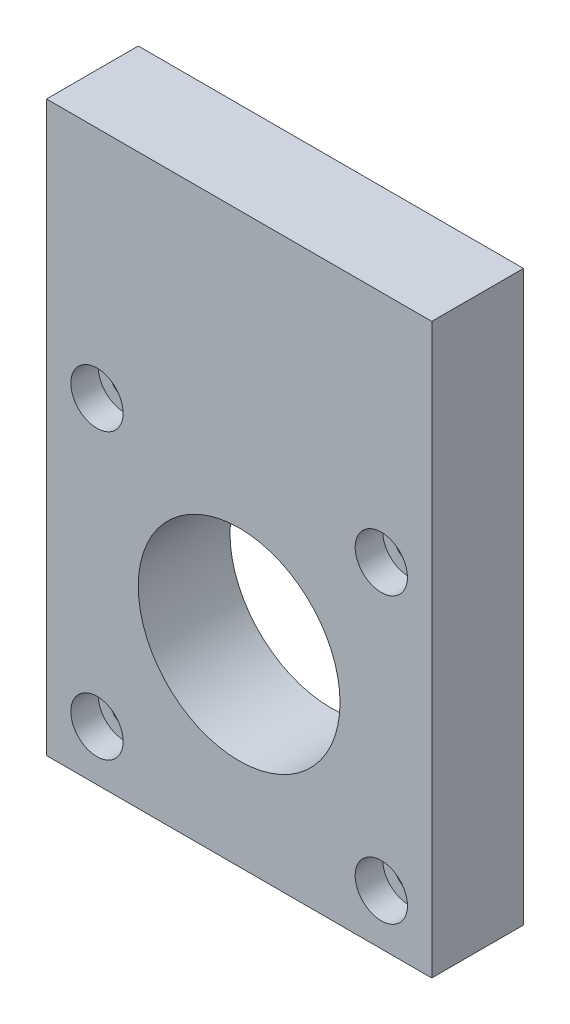
ISO-10303-21;
HEADER;
FILE_DESCRIPTION(('STEP AP214'),'2;1');
FILE_NAME('part.step','',(''),(''),'','','');
FILE_SCHEMA(('AUTOMOTIVE_DESIGN { 1 0 10303 214 1 1 1 1 }'));
ENDSEC;
DATA;
#1=APPLICATION_CONTEXT('core data for automotive mechanical design processes');
#2=APPLICATION_PROTOCOL_DEFINITION('international standard','automotive_design',2000,#1);
#3=PRODUCT_CONTEXT('',#1,'mechanical');
#4=PRODUCT('Part','Part','',(#3));
#5=PRODUCT_RELATED_PRODUCT_CATEGORY('part','',(#4));
#6=PRODUCT_DEFINITION_FORMATION('','',#4);
#7=PRODUCT_DEFINITION_CONTEXT('part definition',#1,'design');
#8=PRODUCT_DEFINITION('design','',#6,#7);
#9=PRODUCT_DEFINITION_SHAPE('','',#8);
#10=(LENGTH_UNIT() NAMED_UNIT(*) SI_UNIT(.MILLI.,.METRE.));
#11=(NAMED_UNIT(*) PLANE_ANGLE_UNIT() SI_UNIT($,.RADIAN.));
#12=(NAMED_UNIT(*) SI_UNIT($,.STERADIAN.) SOLID_ANGLE_UNIT());
#13=UNCERTAINTY_MEASURE_WITH_UNIT(LENGTH_MEASURE(1.E-05),#10,'distance_accuracy_value','');
#14=(GEOMETRIC_REPRESENTATION_CONTEXT(3) GLOBAL_UNCERTAINTY_ASSIGNED_CONTEXT((#13)) GLOBAL_UNIT_ASSIGNED_CONTEXT((#10,
#11,#12)) REPRESENTATION_CONTEXT('',''));
#15=CARTESIAN_POINT('',(0.,0.,0.));
#16=DIRECTION('',(0.,0.,1.));
#17=DIRECTION('',(1.,0.,0.));
#18=AXIS2_PLACEMENT_3D('',#15,#16,#17);
#19=CARTESIAN_POINT('',(-15.5,5.50000000000002,10.));
#20=DIRECTION('',(0.,0.,-1.));
#21=DIRECTION('',(-1.,0.,0.));
#22=AXIS2_PLACEMENT_3D('',#19,#20,#21);
#23=CYLINDRICAL_SURFACE('',#22,1.5);
#24=CARTESIAN_POINT('',(-15.5,5.50000000000002,0.));
#25=DIRECTION('',(0.,0.,-1.));
#26=DIRECTION('',(1.,0.,0.));
#27=AXIS2_PLACEMENT_3D('',#24,#25,#26);
#28=CIRCLE('',#27,1.5);
#29=CARTESIAN_POINT('',(-14.,5.50000000000002,0.));
#30=VERTEX_POINT('',#29);
#31=EDGE_CURVE('E107',#30,#30,#28,.T.);
#32=ORIENTED_EDGE('',*,*,#31,.T.);
#33=EDGE_LOOP('',(#32));
#34=FACE_BOUND('',#33,.T.);
#35=CARTESIAN_POINT('',(-15.5,5.50000000000002,7.));
#36=DIRECTION('',(0.,0.,1.));
#37=DIRECTION('',(1.,0.,0.));
#38=AXIS2_PLACEMENT_3D('',#35,#36,#37);
#39=CIRCLE('',#38,1.5);
#40=CARTESIAN_POINT('',(-14.,5.50000000000002,7.));
#41=VERTEX_POINT('',#40);
#42=EDGE_CURVE('E41',#41,#41,#39,.F.);
#43=ORIENTED_EDGE('',*,*,#42,.F.);
#44=EDGE_LOOP('',(#43));
#45=FACE_BOUND('',#44,.T.);
#46=ADVANCED_FACE('F37',(#34,#45),#23,.F.);
#47=CARTESIAN_POINT('',(15.5,-25.5,10.));
#48=DIRECTION('',(0.,0.,-1.));
#49=DIRECTION('',(-1.,0.,0.));
#50=AXIS2_PLACEMENT_3D('',#47,#48,#49);
#51=CYLINDRICAL_SURFACE('',#50,1.5);
#52=CARTESIAN_POINT('',(15.5,-25.5,0.));
#53=DIRECTION('',(0.,0.,-1.));
#54=DIRECTION('',(1.,0.,0.));
#55=AXIS2_PLACEMENT_3D('',#52,#53,#54);
#56=CIRCLE('',#55,1.5);
#57=CARTESIAN_POINT('',(17.,-25.5,0.));
#58=VERTEX_POINT('',#57);
#59=EDGE_CURVE('E133',#58,#58,#56,.T.);
#60=ORIENTED_EDGE('',*,*,#59,.T.);
#61=EDGE_LOOP('',(#60));
#62=FACE_BOUND('',#61,.T.);
#63=CARTESIAN_POINT('',(15.5,-25.5,7.));
#64=DIRECTION('',(0.,0.,1.));
#65=DIRECTION('',(1.,0.,0.));
#66=AXIS2_PLACEMENT_3D('',#63,#64,#65);
#67=CIRCLE('',#66,1.5);
#68=CARTESIAN_POINT('',(17.,-25.5,7.));
#69=VERTEX_POINT('',#68);
#70=EDGE_CURVE('E119',#69,#69,#67,.F.);
#71=ORIENTED_EDGE('',*,*,#70,.F.);
#72=EDGE_LOOP('',(#71));
#73=FACE_BOUND('',#72,.T.);
#74=ADVANCED_FACE('F167',(#62,#73),#51,.F.);
#75=CARTESIAN_POINT('',(21.,-31.,10.));
#76=DIRECTION('',(-1.,0.,0.));
#77=DIRECTION('',(0.,0.,1.));
#78=AXIS2_PLACEMENT_3D('',#75,#76,#77);
#79=PLANE('',#78);
#80=DIRECTION('',(0.,1.,0.));
#81=VECTOR('',#80,1.);
#82=CARTESIAN_POINT('',(21.,-31.,0.));
#83=LINE('',#82,#81);
#84=CARTESIAN_POINT('',(21.,-31.,0.));
#85=VERTEX_POINT('',#84);
#86=CARTESIAN_POINT('',(21.,31.,0.));
#87=VERTEX_POINT('',#86);
#88=EDGE_CURVE('E104',#85,#87,#83,.T.);
#89=ORIENTED_EDGE('',*,*,#88,.T.);
#90=DIRECTION('',(0.,0.,-1.));
#91=VECTOR('',#90,1.);
#92=CARTESIAN_POINT('',(21.,31.,10.));
#93=LINE('',#92,#91);
#94=CARTESIAN_POINT('',(21.,31.,10.));
#95=VERTEX_POINT('',#94);
#96=EDGE_CURVE('E11',#95,#87,#93,.T.);
#97=ORIENTED_EDGE('',*,*,#96,.F.);
#98=DIRECTION('',(0.,1.,0.));
#99=VECTOR('',#98,1.);
#100=CARTESIAN_POINT('',(21.,-31.,10.));
#101=LINE('',#100,#99);
#102=CARTESIAN_POINT('',(21.,-31.,10.));
#103=VERTEX_POINT('',#102);
#104=EDGE_CURVE('E91',#103,#95,#101,.T.);
#105=ORIENTED_EDGE('',*,*,#104,.F.);
#106=DIRECTION('',(0.,0.,-1.));
#107=VECTOR('',#106,1.);
#108=CARTESIAN_POINT('',(21.,-31.,10.));
#109=LINE('',#108,#107);
#110=EDGE_CURVE('E100',#103,#85,#109,.T.);
#111=ORIENTED_EDGE('',*,*,#110,.T.);
#112=EDGE_LOOP('',(#89,#97,#105,#111));
#113=FACE_BOUND('',#112,.T.);
#114=ADVANCED_FACE('F39',(#113),#79,.F.);
#115=CARTESIAN_POINT('',(21.,31.,10.));
#116=DIRECTION('',(0.,-1.,0.));
#117=DIRECTION('',(0.,0.,-1.));
#118=AXIS2_PLACEMENT_3D('',#115,#116,#117);
#119=PLANE('',#118);
#120=DIRECTION('',(-1.,0.,0.));
#121=VECTOR('',#120,1.);
#122=CARTESIAN_POINT('',(21.,31.,0.));
#123=LINE('',#122,#121);
#124=CARTESIAN_POINT('',(-21.,31.,0.));
#125=VERTEX_POINT('',#124);
#126=EDGE_CURVE('E95',#87,#125,#123,.T.);
#127=ORIENTED_EDGE('',*,*,#126,.T.);
#128=DIRECTION('',(0.,0.,-1.));
#129=VECTOR('',#128,1.);
#130=CARTESIAN_POINT('',(-21.,31.,10.));
#131=LINE('',#130,#129);
#132=CARTESIAN_POINT('',(-21.,31.,10.));
#133=VERTEX_POINT('',#132);
#134=EDGE_CURVE('E47',#133,#125,#131,.T.);
#135=ORIENTED_EDGE('',*,*,#134,.F.);
#136=DIRECTION('',(-1.,0.,0.));
#137=VECTOR('',#136,1.);
#138=CARTESIAN_POINT('',(21.,31.,10.));
#139=LINE('',#138,#137);
#140=EDGE_CURVE('E86',#95,#133,#139,.T.);
#141=ORIENTED_EDGE('',*,*,#140,.F.);
#142=ORIENTED_EDGE('',*,*,#96,.T.);
#143=EDGE_LOOP('',(#127,#135,#141,#142));
#144=FACE_BOUND('',#143,.T.);
#145=ADVANCED_FACE('F94',(#144),#119,.F.);
#146=CARTESIAN_POINT('',(-21.,-31.,10.));
#147=DIRECTION('',(1.,0.,0.));
#148=DIRECTION('',(0.,1.,0.));
#149=AXIS2_PLACEMENT_3D('',#146,#147,#148);
#150=PLANE('',#149);
#151=DIRECTION('',(0.,-1.,0.));
#152=VECTOR('',#151,1.);
#153=CARTESIAN_POINT('',(-21.,-31.,0.));
#154=LINE('',#153,#152);
#155=CARTESIAN_POINT('',(-21.,-31.,0.));
#156=VERTEX_POINT('',#155);
#157=EDGE_CURVE('E73',#125,#156,#154,.T.);
#158=ORIENTED_EDGE('',*,*,#157,.T.);
#159=DIRECTION('',(0.,0.,-1.));
#160=VECTOR('',#159,1.);
#161=CARTESIAN_POINT('',(-21.,-31.,10.));
#162=LINE('',#161,#160);
#163=CARTESIAN_POINT('',(-21.,-31.,10.));
#164=VERTEX_POINT('',#163);
#165=EDGE_CURVE('E96',#164,#156,#162,.T.);
#166=ORIENTED_EDGE('',*,*,#165,.F.);
#167=DIRECTION('',(0.,-1.,0.));
#168=VECTOR('',#167,1.);
#169=CARTESIAN_POINT('',(-21.,-31.,10.));
#170=LINE('',#169,#168);
#171=EDGE_CURVE('E89',#133,#164,#170,.T.);
#172=ORIENTED_EDGE('',*,*,#171,.F.);
#173=ORIENTED_EDGE('',*,*,#134,.T.);
#174=EDGE_LOOP('',(#158,#166,#172,#173));
#175=FACE_BOUND('',#174,.T.);
#176=ADVANCED_FACE('F98',(#175),#150,.F.);
#177=CARTESIAN_POINT('',(21.,-31.,10.));
#178=DIRECTION('',(0.,1.,0.));
#179=DIRECTION('',(0.,0.,1.));
#180=AXIS2_PLACEMENT_3D('',#177,#178,#179);
#181=PLANE('',#180);
#182=DIRECTION('',(1.,0.,0.));
#183=VECTOR('',#182,1.);
#184=CARTESIAN_POINT('',(21.,-31.,0.));
#185=LINE('',#184,#183);
#186=EDGE_CURVE('E79',#156,#85,#185,.T.);
#187=ORIENTED_EDGE('',*,*,#186,.T.);
#188=ORIENTED_EDGE('',*,*,#110,.F.);
#189=DIRECTION('',(1.,0.,0.));
#190=VECTOR('',#189,1.);
#191=CARTESIAN_POINT('',(21.,-31.,10.));
#192=LINE('',#191,#190);
#193=EDGE_CURVE('E56',#164,#103,#192,.T.);
#194=ORIENTED_EDGE('',*,*,#193,.F.);
#195=ORIENTED_EDGE('',*,*,#165,.T.);
#196=EDGE_LOOP('',(#187,#188,#194,#195));
#197=FACE_BOUND('',#196,.T.);
#198=ADVANCED_FACE('F156',(#197),#181,.F.);
#199=CARTESIAN_POINT('',(0.,0.,10.));
#200=DIRECTION('',(0.,0.,1.));
#201=DIRECTION('',(1.,0.,0.));
#202=AXIS2_PLACEMENT_3D('',#199,#200,#201);
#203=PLANE('',#202);
#204=CARTESIAN_POINT('',(-15.5,-25.5,10.));
#205=DIRECTION('',(0.,0.,1.));
#206=DIRECTION('',(-1.,0.,0.));
#207=AXIS2_PLACEMENT_3D('',#204,#205,#206);
#208=CIRCLE('',#207,2.85);
#209=CARTESIAN_POINT('',(-18.35,-25.5,10.));
#210=VERTEX_POINT('',#209);
#211=EDGE_CURVE('E237',#210,#210,#208,.T.);
#212=ORIENTED_EDGE('',*,*,#211,.F.);
#213=EDGE_LOOP('',(#212));
#214=FACE_BOUND('',#213,.T.);
#215=CARTESIAN_POINT('',(15.5,-25.5,10.));
#216=DIRECTION('',(0.,0.,1.));
#217=DIRECTION('',(1.,0.,0.));
#218=AXIS2_PLACEMENT_3D('',#215,#216,#217);
#219=CIRCLE('',#218,2.85);
#220=CARTESIAN_POINT('',(18.35,-25.5,10.));
#221=VERTEX_POINT('',#220);
#222=EDGE_CURVE('E243',#221,#221,#219,.T.);
#223=ORIENTED_EDGE('',*,*,#222,.F.);
#224=EDGE_LOOP('',(#223));
#225=FACE_BOUND('',#224,.T.);
#226=CARTESIAN_POINT('',(15.5,5.50000000000003,10.));
#227=DIRECTION('',(0.,0.,1.));
#228=DIRECTION('',(-1.,0.,0.));
#229=AXIS2_PLACEMENT_3D('',#226,#227,#228);
#230=CIRCLE('',#229,2.85);
#231=CARTESIAN_POINT('',(12.65,5.50000000000003,10.));
#232=VERTEX_POINT('',#231);
#233=EDGE_CURVE('E249',#232,#232,#230,.T.);
#234=ORIENTED_EDGE('',*,*,#233,.F.);
#235=EDGE_LOOP('',(#234));
#236=FACE_BOUND('',#235,.T.);
#237=CARTESIAN_POINT('',(-15.5,5.50000000000002,10.));
#238=DIRECTION('',(0.,0.,1.));
#239=DIRECTION('',(1.,0.,0.));
#240=AXIS2_PLACEMENT_3D('',#237,#238,#239);
#241=CIRCLE('',#240,2.85);
#242=CARTESIAN_POINT('',(-12.65,5.50000000000002,10.));
#243=VERTEX_POINT('',#242);
#244=EDGE_CURVE('E232',#243,#243,#241,.T.);
#245=ORIENTED_EDGE('',*,*,#244,.F.);
#246=EDGE_LOOP('',(#245));
#247=FACE_BOUND('',#246,.T.);
#248=CARTESIAN_POINT('',(0.,-9.99999999999998,10.));
#249=DIRECTION('',(0.,0.,-1.));
#250=DIRECTION('',(-1.,0.,0.));
#251=AXIS2_PLACEMENT_3D('',#248,#249,#250);
#252=CIRCLE('',#251,11.);
#253=CARTESIAN_POINT('',(-11.,-9.99999999999998,10.));
#254=VERTEX_POINT('',#253);
#255=EDGE_CURVE('E128',#254,#254,#252,.T.);
#256=ORIENTED_EDGE('',*,*,#255,.T.);
#257=EDGE_LOOP('',(#256));
#258=FACE_BOUND('',#257,.T.);
#259=ORIENTED_EDGE('',*,*,#104,.T.);
#260=ORIENTED_EDGE('',*,*,#140,.T.);
#261=ORIENTED_EDGE('',*,*,#171,.T.);
#262=ORIENTED_EDGE('',*,*,#193,.T.);
#263=EDGE_LOOP('',(#259,#260,#261,#262));
#264=FACE_BOUND('',#263,.T.);
#265=ADVANCED_FACE('F87',(#214,#225,#236,#247,#258,#264),#203,.T.);
#266=CARTESIAN_POINT('',(0.,0.,0.));
#267=DIRECTION('',(0.,0.,1.));
#268=DIRECTION('',(1.,0.,0.));
#269=AXIS2_PLACEMENT_3D('',#266,#267,#268);
#270=PLANE('',#269);
#271=CARTESIAN_POINT('',(-15.5,-25.5,0.));
#272=DIRECTION('',(0.,0.,-1.));
#273=DIRECTION('',(-1.,0.,0.));
#274=AXIS2_PLACEMENT_3D('',#271,#272,#273);
#275=CIRCLE('',#274,1.5);
#276=CARTESIAN_POINT('',(-17.,-25.5,0.));
#277=VERTEX_POINT('',#276);
#278=EDGE_CURVE('E137',#277,#277,#275,.T.);
#279=ORIENTED_EDGE('',*,*,#278,.F.);
#280=EDGE_LOOP('',(#279));
#281=FACE_BOUND('',#280,.T.);
#282=CARTESIAN_POINT('',(15.5,5.50000000000002,0.));
#283=DIRECTION('',(0.,0.,-1.));
#284=DIRECTION('',(-1.,0.,0.));
#285=AXIS2_PLACEMENT_3D('',#282,#283,#284);
#286=CIRCLE('',#285,1.5);
#287=CARTESIAN_POINT('',(14.,5.50000000000002,0.));
#288=VERTEX_POINT('',#287);
#289=EDGE_CURVE('E140',#288,#288,#286,.T.);
#290=ORIENTED_EDGE('',*,*,#289,.F.);
#291=EDGE_LOOP('',(#290));
#292=FACE_BOUND('',#291,.T.);
#293=ORIENTED_EDGE('',*,*,#59,.F.);
#294=EDGE_LOOP('',(#293));
#295=FACE_BOUND('',#294,.T.);
#296=CARTESIAN_POINT('',(0.,-9.99999999999998,0.));
#297=DIRECTION('',(0.,0.,-1.));
#298=DIRECTION('',(-1.,0.,0.));
#299=AXIS2_PLACEMENT_3D('',#296,#297,#298);
#300=CIRCLE('',#299,11.);
#301=CARTESIAN_POINT('',(-11.,-9.99999999999998,0.));
#302=VERTEX_POINT('',#301);
#303=EDGE_CURVE('E124',#302,#302,#300,.T.);
#304=ORIENTED_EDGE('',*,*,#303,.F.);
#305=EDGE_LOOP('',(#304));
#306=FACE_BOUND('',#305,.T.);
#307=ORIENTED_EDGE('',*,*,#31,.F.);
#308=EDGE_LOOP('',(#307));
#309=FACE_BOUND('',#308,.T.);
#310=ORIENTED_EDGE('',*,*,#88,.F.);
#311=ORIENTED_EDGE('',*,*,#186,.F.);
#312=ORIENTED_EDGE('',*,*,#157,.F.);
#313=ORIENTED_EDGE('',*,*,#126,.F.);
#314=EDGE_LOOP('',(#310,#311,#312,#313));
#315=FACE_BOUND('',#314,.T.);
#316=ADVANCED_FACE('F148',(#281,#292,#295,#306,#309,#315),#270,.F.);
#317=CARTESIAN_POINT('',(0.,-9.99999999999998,10.));
#318=DIRECTION('',(0.,0.,-1.));
#319=DIRECTION('',(-1.,0.,0.));
#320=AXIS2_PLACEMENT_3D('',#317,#318,#319);
#321=CYLINDRICAL_SURFACE('',#320,11.);
#322=ORIENTED_EDGE('',*,*,#255,.F.);
#323=EDGE_LOOP('',(#322));
#324=FACE_BOUND('',#323,.T.);
#325=ORIENTED_EDGE('',*,*,#303,.T.);
#326=EDGE_LOOP('',(#325));
#327=FACE_BOUND('',#326,.T.);
#328=ADVANCED_FACE('F151',(#324,#327),#321,.F.);
#329=CARTESIAN_POINT('',(15.5,5.50000000000002,10.));
#330=DIRECTION('',(0.,0.,-1.));
#331=DIRECTION('',(-1.,0.,0.));
#332=AXIS2_PLACEMENT_3D('',#329,#330,#331);
#333=CYLINDRICAL_SURFACE('',#332,1.5);
#334=CARTESIAN_POINT('',(15.5,5.50000000000002,7.));
#335=DIRECTION('',(0.,0.,-1.));
#336=DIRECTION('',(-1.,0.,0.));
#337=AXIS2_PLACEMENT_3D('',#334,#335,#336);
#338=CIRCLE('',#337,1.5);
#339=CARTESIAN_POINT('',(14.,5.50000000000002,7.));
#340=VERTEX_POINT('',#339);
#341=EDGE_CURVE('E116',#340,#340,#338,.F.);
#342=ORIENTED_EDGE('',*,*,#341,.T.);
#343=EDGE_LOOP('',(#342));
#344=FACE_BOUND('',#343,.T.);
#345=ORIENTED_EDGE('',*,*,#289,.T.);
#346=EDGE_LOOP('',(#345));
#347=FACE_BOUND('',#346,.T.);
#348=ADVANCED_FACE('F175',(#344,#347),#333,.F.);
#349=CARTESIAN_POINT('',(-15.5,-25.5,10.));
#350=DIRECTION('',(0.,0.,-1.));
#351=DIRECTION('',(-1.,0.,0.));
#352=AXIS2_PLACEMENT_3D('',#349,#350,#351);
#353=CYLINDRICAL_SURFACE('',#352,1.5);
#354=CARTESIAN_POINT('',(-15.5,-25.5,7.));
#355=DIRECTION('',(0.,0.,-1.));
#356=DIRECTION('',(-1.,0.,0.));
#357=AXIS2_PLACEMENT_3D('',#354,#355,#356);
#358=CIRCLE('',#357,1.5);
#359=CARTESIAN_POINT('',(-17.,-25.5,7.));
#360=VERTEX_POINT('',#359);
#361=EDGE_CURVE('E113',#360,#360,#358,.F.);
#362=ORIENTED_EDGE('',*,*,#361,.T.);
#363=EDGE_LOOP('',(#362));
#364=FACE_BOUND('',#363,.T.);
#365=ORIENTED_EDGE('',*,*,#278,.T.);
#366=EDGE_LOOP('',(#365));
#367=FACE_BOUND('',#366,.T.);
#368=ADVANCED_FACE('F178',(#364,#367),#353,.F.);
#369=CARTESIAN_POINT('',(-15.5,-25.5,7.));
#370=DIRECTION('',(0.,0.,-1.));
#371=DIRECTION('',(-1.,0.,0.));
#372=AXIS2_PLACEMENT_3D('',#369,#370,#371);
#373=PLANE('',#372);
#374=CARTESIAN_POINT('',(-15.5,-25.5,7.));
#375=DIRECTION('',(0.,0.,1.));
#376=DIRECTION('',(-1.,0.,0.));
#377=AXIS2_PLACEMENT_3D('',#374,#375,#376);
#378=CIRCLE('',#377,2.85);
#379=CARTESIAN_POINT('',(-18.35,-25.5,7.));
#380=VERTEX_POINT('',#379);
#381=EDGE_CURVE('E240',#380,#380,#378,.T.);
#382=ORIENTED_EDGE('',*,*,#381,.T.);
#383=EDGE_LOOP('',(#382));
#384=FACE_BOUND('',#383,.T.);
#385=ORIENTED_EDGE('',*,*,#361,.F.);
#386=EDGE_LOOP('',(#385));
#387=FACE_BOUND('',#386,.T.);
#388=ADVANCED_FACE('F182',(#384,#387),#373,.F.);
#389=CARTESIAN_POINT('',(-15.5,-25.5,7.));
#390=DIRECTION('',(0.,0.,1.));
#391=DIRECTION('',(1.,0.,0.));
#392=AXIS2_PLACEMENT_3D('',#389,#390,#391);
#393=CYLINDRICAL_SURFACE('',#392,2.85);
#394=ORIENTED_EDGE('',*,*,#381,.F.);
#395=EDGE_LOOP('',(#394));
#396=FACE_BOUND('',#395,.T.);
#397=ORIENTED_EDGE('',*,*,#211,.T.);
#398=EDGE_LOOP('',(#397));
#399=FACE_BOUND('',#398,.T.);
#400=ADVANCED_FACE('F196',(#396,#399),#393,.F.);
#401=CARTESIAN_POINT('',(15.5,5.50000000000003,7.));
#402=DIRECTION('',(0.,0.,-1.));
#403=DIRECTION('',(-1.,0.,0.));
#404=AXIS2_PLACEMENT_3D('',#401,#402,#403);
#405=PLANE('',#404);
#406=CARTESIAN_POINT('',(15.5,5.50000000000003,7.));
#407=DIRECTION('',(0.,0.,1.));
#408=DIRECTION('',(-1.,0.,0.));
#409=AXIS2_PLACEMENT_3D('',#406,#407,#408);
#410=CIRCLE('',#409,2.85);
#411=CARTESIAN_POINT('',(12.65,5.50000000000003,7.));
#412=VERTEX_POINT('',#411);
#413=EDGE_CURVE('E222',#412,#412,#410,.T.);
#414=ORIENTED_EDGE('',*,*,#413,.T.);
#415=EDGE_LOOP('',(#414));
#416=FACE_BOUND('',#415,.T.);
#417=ORIENTED_EDGE('',*,*,#341,.F.);
#418=EDGE_LOOP('',(#417));
#419=FACE_BOUND('',#418,.T.);
#420=ADVANCED_FACE('F199',(#416,#419),#405,.F.);
#421=CARTESIAN_POINT('',(15.5,5.50000000000003,7.));
#422=DIRECTION('',(0.,0.,1.));
#423=DIRECTION('',(1.,0.,0.));
#424=AXIS2_PLACEMENT_3D('',#421,#422,#423);
#425=CYLINDRICAL_SURFACE('',#424,2.85);
#426=ORIENTED_EDGE('',*,*,#413,.F.);
#427=EDGE_LOOP('',(#426));
#428=FACE_BOUND('',#427,.T.);
#429=ORIENTED_EDGE('',*,*,#233,.T.);
#430=EDGE_LOOP('',(#429));
#431=FACE_BOUND('',#430,.T.);
#432=ADVANCED_FACE('F210',(#428,#431),#425,.F.);
#433=CARTESIAN_POINT('',(15.5,-25.5,7.));
#434=DIRECTION('',(0.,0.,1.));
#435=DIRECTION('',(1.,0.,0.));
#436=AXIS2_PLACEMENT_3D('',#433,#434,#435);
#437=PLANE('',#436);
#438=CARTESIAN_POINT('',(15.5,-25.5,7.));
#439=DIRECTION('',(0.,0.,1.));
#440=DIRECTION('',(1.,0.,0.));
#441=AXIS2_PLACEMENT_3D('',#438,#439,#440);
#442=CIRCLE('',#441,2.85);
#443=CARTESIAN_POINT('',(18.35,-25.5,7.));
#444=VERTEX_POINT('',#443);
#445=EDGE_CURVE('E246',#444,#444,#442,.T.);
#446=ORIENTED_EDGE('',*,*,#445,.T.);
#447=EDGE_LOOP('',(#446));
#448=FACE_BOUND('',#447,.T.);
#449=ORIENTED_EDGE('',*,*,#70,.T.);
#450=EDGE_LOOP('',(#449));
#451=FACE_BOUND('',#450,.T.);
#452=ADVANCED_FACE('F206',(#448,#451),#437,.T.);
#453=CARTESIAN_POINT('',(15.5,-25.5,7.));
#454=DIRECTION('',(0.,0.,1.));
#455=DIRECTION('',(1.,0.,0.));
#456=AXIS2_PLACEMENT_3D('',#453,#454,#455);
#457=CYLINDRICAL_SURFACE('',#456,2.85);
#458=ORIENTED_EDGE('',*,*,#445,.F.);
#459=EDGE_LOOP('',(#458));
#460=FACE_BOUND('',#459,.T.);
#461=ORIENTED_EDGE('',*,*,#222,.T.);
#462=EDGE_LOOP('',(#461));
#463=FACE_BOUND('',#462,.T.);
#464=ADVANCED_FACE('F194',(#460,#463),#457,.F.);
#465=CARTESIAN_POINT('',(-15.5,5.50000000000002,7.));
#466=DIRECTION('',(0.,0.,1.));
#467=DIRECTION('',(1.,0.,0.));
#468=AXIS2_PLACEMENT_3D('',#465,#466,#467);
#469=PLANE('',#468);
#470=CARTESIAN_POINT('',(-15.5,5.50000000000002,7.));
#471=DIRECTION('',(0.,0.,1.));
#472=DIRECTION('',(1.,0.,0.));
#473=AXIS2_PLACEMENT_3D('',#470,#471,#472);
#474=CIRCLE('',#473,2.85);
#475=CARTESIAN_POINT('',(-12.65,5.50000000000002,7.));
#476=VERTEX_POINT('',#475);
#477=EDGE_CURVE('E117',#476,#476,#474,.T.);
#478=ORIENTED_EDGE('',*,*,#477,.T.);
#479=EDGE_LOOP('',(#478));
#480=FACE_BOUND('',#479,.T.);
#481=ORIENTED_EDGE('',*,*,#42,.T.);
#482=EDGE_LOOP('',(#481));
#483=FACE_BOUND('',#482,.T.);
#484=ADVANCED_FACE('F190',(#480,#483),#469,.T.);
#485=CARTESIAN_POINT('',(-15.5,5.50000000000002,7.));
#486=DIRECTION('',(0.,0.,1.));
#487=DIRECTION('',(1.,0.,0.));
#488=AXIS2_PLACEMENT_3D('',#485,#486,#487);
#489=CYLINDRICAL_SURFACE('',#488,2.85);
#490=ORIENTED_EDGE('',*,*,#477,.F.);
#491=EDGE_LOOP('',(#490));
#492=FACE_BOUND('',#491,.T.);
#493=ORIENTED_EDGE('',*,*,#244,.T.);
#494=EDGE_LOOP('',(#493));
#495=FACE_BOUND('',#494,.T.);
#496=ADVANCED_FACE('F187',(#492,#495),#489,.F.);
#497=CLOSED_SHELL('',(#46,#74,#114,#145,#176,#198,#265,#316,#328,#348,#368,#388,#400,#420,#432,
#452,#464,#484,#496));
#498=MANIFOLD_SOLID_BREP('B2',#497);
#499=ADVANCED_BREP_SHAPE_REPRESENTATION('',(#18,#498),#14);
#500=SHAPE_DEFINITION_REPRESENTATION(#9,#499);
ENDSEC;
END-ISO-10303-21;
